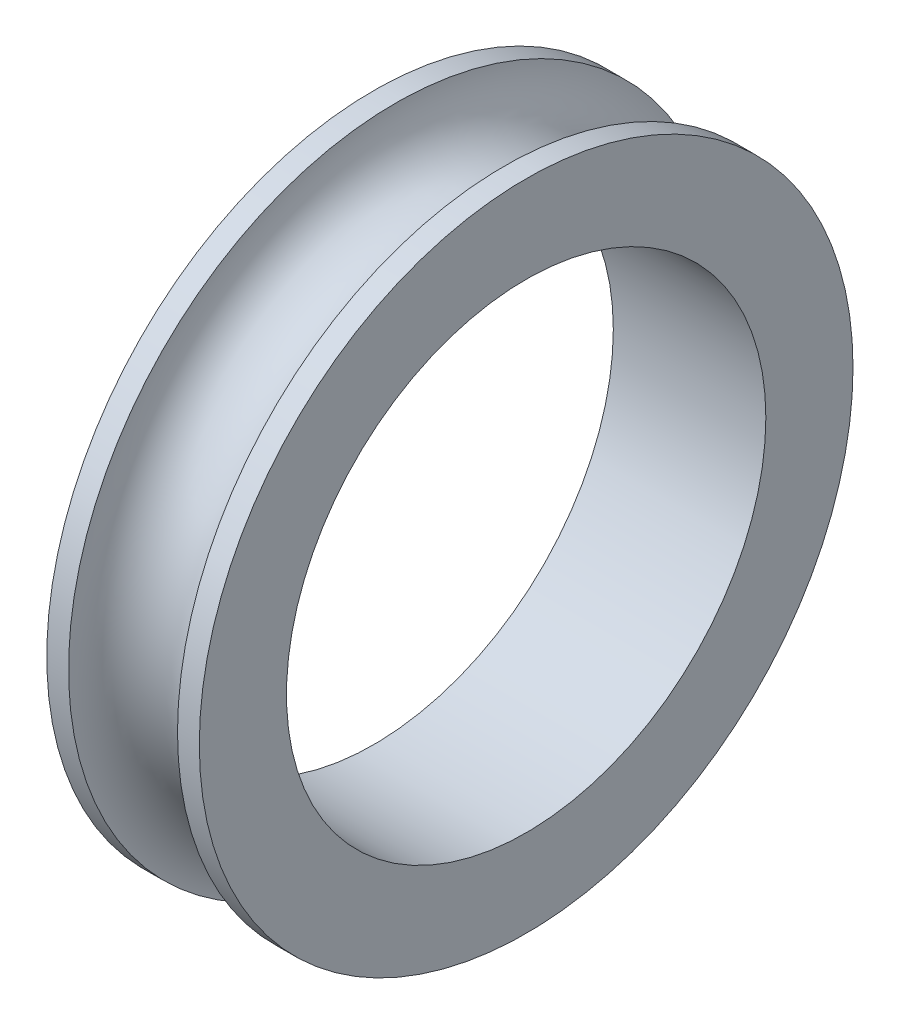
ISO-10303-21;
HEADER;
FILE_DESCRIPTION(('STEP AP214'),'2;1');
FILE_NAME('part.step','',(''),(''),'','','');
FILE_SCHEMA(('AUTOMOTIVE_DESIGN { 1 0 10303 214 1 1 1 1 }'));
ENDSEC;
DATA;
#1=APPLICATION_CONTEXT('core data for automotive mechanical design processes');
#2=APPLICATION_PROTOCOL_DEFINITION('international standard','automotive_design',2000,#1);
#3=PRODUCT_CONTEXT('',#1,'mechanical');
#4=PRODUCT('Part','Part','',(#3));
#5=PRODUCT_RELATED_PRODUCT_CATEGORY('part','',(#4));
#6=PRODUCT_DEFINITION_FORMATION('','',#4);
#7=PRODUCT_DEFINITION_CONTEXT('part definition',#1,'design');
#8=PRODUCT_DEFINITION('design','',#6,#7);
#9=PRODUCT_DEFINITION_SHAPE('','',#8);
#10=(LENGTH_UNIT() NAMED_UNIT(*) SI_UNIT(.MILLI.,.METRE.));
#11=(NAMED_UNIT(*) PLANE_ANGLE_UNIT() SI_UNIT($,.RADIAN.));
#12=(NAMED_UNIT(*) SI_UNIT($,.STERADIAN.) SOLID_ANGLE_UNIT());
#13=UNCERTAINTY_MEASURE_WITH_UNIT(LENGTH_MEASURE(1.E-05),#10,'distance_accuracy_value','');
#14=(GEOMETRIC_REPRESENTATION_CONTEXT(3) GLOBAL_UNCERTAINTY_ASSIGNED_CONTEXT((#13)) GLOBAL_UNIT_ASSIGNED_CONTEXT((#10,
#11,#12)) REPRESENTATION_CONTEXT('',''));
#15=CARTESIAN_POINT('',(0.,0.,0.));
#16=DIRECTION('',(0.,0.,1.));
#17=DIRECTION('',(1.,0.,0.));
#18=AXIS2_PLACEMENT_3D('',#15,#16,#17);
#19=CARTESIAN_POINT('',(7.,0.,0.));
#20=DIRECTION('',(-1.,0.,0.));
#21=DIRECTION('',(0.,0.,1.));
#22=AXIS2_PLACEMENT_3D('',#19,#20,#21);
#23=CYLINDRICAL_SURFACE('',#22,15.);
#24=CARTESIAN_POINT('',(6.,0.,0.));
#25=DIRECTION('',(-1.,0.,0.));
#26=DIRECTION('',(0.,0.,1.));
#27=AXIS2_PLACEMENT_3D('',#24,#25,#26);
#28=CIRCLE('',#27,15.);
#29=CARTESIAN_POINT('',(6.,0.,15.));
#30=VERTEX_POINT('',#29);
#31=EDGE_CURVE('E35',#30,#30,#28,.F.);
#32=ORIENTED_EDGE('',*,*,#31,.T.);
#33=EDGE_LOOP('',(#32));
#34=FACE_BOUND('',#33,.T.);
#35=CARTESIAN_POINT('',(7.,0.,0.));
#36=DIRECTION('',(1.,0.,0.));
#37=DIRECTION('',(0.,0.,-1.));
#38=AXIS2_PLACEMENT_3D('',#35,#36,#37);
#39=CIRCLE('',#38,15.);
#40=CARTESIAN_POINT('',(7.,0.,-15.));
#41=VERTEX_POINT('',#40);
#42=EDGE_CURVE('E10',#41,#41,#39,.T.);
#43=ORIENTED_EDGE('',*,*,#42,.F.);
#44=EDGE_LOOP('',(#43));
#45=FACE_BOUND('',#44,.T.);
#46=ADVANCED_FACE('F31',(#34,#45),#23,.T.);
#47=CARTESIAN_POINT('',(7.,0.,0.));
#48=DIRECTION('',(1.,0.,0.));
#49=DIRECTION('',(0.,0.,-1.));
#50=AXIS2_PLACEMENT_3D('',#47,#48,#49);
#51=PLANE('',#50);
#52=ORIENTED_EDGE('',*,*,#42,.T.);
#53=EDGE_LOOP('',(#52));
#54=FACE_BOUND('',#53,.T.);
#55=CARTESIAN_POINT('',(7.,0.,0.));
#56=DIRECTION('',(1.,0.,0.));
#57=DIRECTION('',(0.,0.,-1.));
#58=AXIS2_PLACEMENT_3D('',#55,#56,#57);
#59=CIRCLE('',#58,11.);
#60=CARTESIAN_POINT('',(7.,0.,-11.));
#61=VERTEX_POINT('',#60);
#62=EDGE_CURVE('E44',#61,#61,#59,.T.);
#63=ORIENTED_EDGE('',*,*,#62,.F.);
#64=EDGE_LOOP('',(#63));
#65=FACE_BOUND('',#64,.T.);
#66=ADVANCED_FACE('F65',(#54,#65),#51,.T.);
#67=CARTESIAN_POINT('',(0.,0.,0.));
#68=DIRECTION('',(1.,0.,0.));
#69=DIRECTION('',(0.,0.,-1.));
#70=AXIS2_PLACEMENT_3D('',#67,#68,#69);
#71=PLANE('',#70);
#72=CARTESIAN_POINT('',(0.,0.,0.));
#73=DIRECTION('',(1.,0.,0.));
#74=DIRECTION('',(0.,0.,-1.));
#75=AXIS2_PLACEMENT_3D('',#72,#73,#74);
#76=CIRCLE('',#75,15.);
#77=CARTESIAN_POINT('',(0.,0.,-15.));
#78=VERTEX_POINT('',#77);
#79=EDGE_CURVE('E39',#78,#78,#76,.T.);
#80=ORIENTED_EDGE('',*,*,#79,.F.);
#81=EDGE_LOOP('',(#80));
#82=FACE_BOUND('',#81,.T.);
#83=CARTESIAN_POINT('',(0.,0.,0.));
#84=DIRECTION('',(1.,0.,0.));
#85=DIRECTION('',(0.,0.,-1.));
#86=AXIS2_PLACEMENT_3D('',#83,#84,#85);
#87=CIRCLE('',#86,11.);
#88=CARTESIAN_POINT('',(0.,0.,-11.));
#89=VERTEX_POINT('',#88);
#90=EDGE_CURVE('E47',#89,#89,#87,.T.);
#91=ORIENTED_EDGE('',*,*,#90,.T.);
#92=EDGE_LOOP('',(#91));
#93=FACE_BOUND('',#92,.T.);
#94=ADVANCED_FACE('F67',(#82,#93),#71,.F.);
#95=CARTESIAN_POINT('',(1.,0.,0.));
#96=DIRECTION('',(1.,0.,0.));
#97=DIRECTION('',(0.,0.,-1.));
#98=AXIS2_PLACEMENT_3D('',#95,#96,#97);
#99=CIRCLE('',#98,15.);
#100=CARTESIAN_POINT('',(1.,0.,-15.));
#101=VERTEX_POINT('',#100);
#102=EDGE_CURVE('E49',#101,#101,#99,.F.);
#103=ORIENTED_EDGE('',*,*,#102,.T.);
#104=EDGE_LOOP('',(#103));
#105=FACE_BOUND('',#104,.T.);
#106=ORIENTED_EDGE('',*,*,#79,.T.);
#107=EDGE_LOOP('',(#106));
#108=FACE_BOUND('',#107,.T.);
#109=ADVANCED_FACE('F33',(#105,#108),#23,.T.);
#110=CARTESIAN_POINT('',(7.,0.,0.));
#111=DIRECTION('',(-1.,0.,0.));
#112=DIRECTION('',(0.,0.,1.));
#113=AXIS2_PLACEMENT_3D('',#110,#111,#112);
#114=CYLINDRICAL_SURFACE('',#113,11.);
#115=ORIENTED_EDGE('',*,*,#62,.T.);
#116=EDGE_LOOP('',(#115));
#117=FACE_BOUND('',#116,.T.);
#118=ORIENTED_EDGE('',*,*,#90,.F.);
#119=EDGE_LOOP('',(#118));
#120=FACE_BOUND('',#119,.T.);
#121=ADVANCED_FACE('F62',(#117,#120),#114,.F.);
#122=CARTESIAN_POINT('',(3.5,0.,0.));
#123=DIRECTION('',(1.,0.,0.));
#124=DIRECTION('',(0.,0.,-1.));
#125=AXIS2_PLACEMENT_3D('',#122,#123,#124);
#126=TOROIDAL_SURFACE('',#125,15.,2.5);
#127=ORIENTED_EDGE('',*,*,#102,.F.);
#128=EDGE_LOOP('',(#127));
#129=FACE_BOUND('',#128,.T.);
#130=ORIENTED_EDGE('',*,*,#31,.F.);
#131=EDGE_LOOP('',(#130));
#132=FACE_BOUND('',#131,.T.);
#133=ADVANCED_FACE('F77',(#129,#132),#126,.F.);
#134=CLOSED_SHELL('',(#46,#66,#94,#109,#121,#133));
#135=MANIFOLD_SOLID_BREP('B2',#134);
#136=ADVANCED_BREP_SHAPE_REPRESENTATION('',(#18,#135),#14);
#137=SHAPE_DEFINITION_REPRESENTATION(#9,#136);
ENDSEC;
END-ISO-10303-21;
